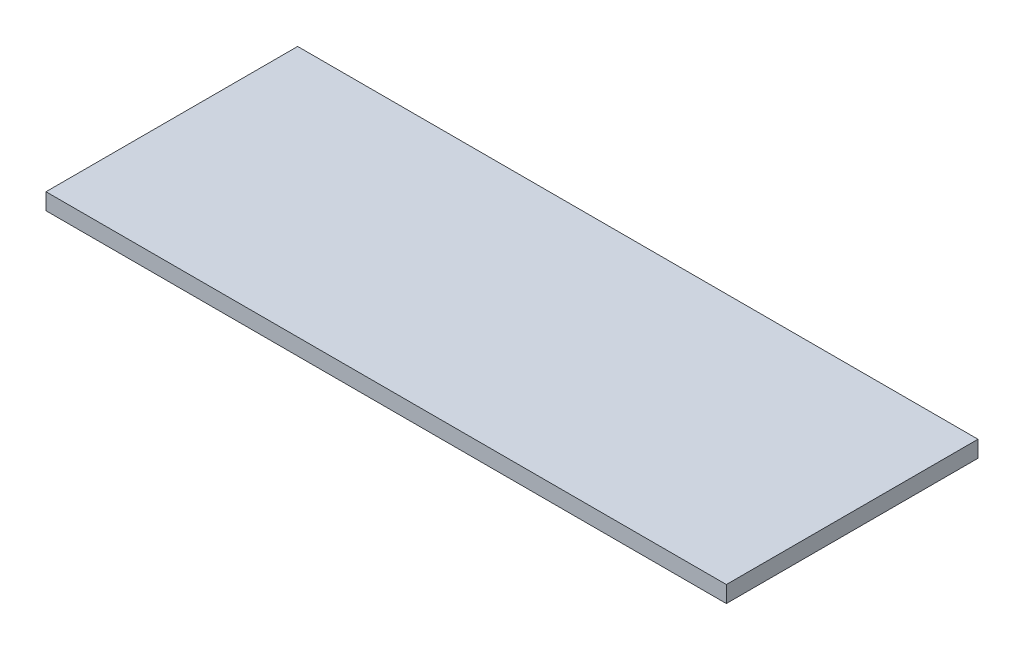
ISO-10303-21;
HEADER;
FILE_DESCRIPTION(('STEP AP214'),'2;1');
FILE_NAME('part.step','',(''),(''),'','','');
FILE_SCHEMA(('AUTOMOTIVE_DESIGN { 1 0 10303 214 1 1 1 1 }'));
ENDSEC;
DATA;
#1=APPLICATION_CONTEXT('core data for automotive mechanical design processes');
#2=APPLICATION_PROTOCOL_DEFINITION('international standard','automotive_design',2000,#1);
#3=PRODUCT_CONTEXT('',#1,'mechanical');
#4=PRODUCT('Part','Part','',(#3));
#5=PRODUCT_RELATED_PRODUCT_CATEGORY('part','',(#4));
#6=PRODUCT_DEFINITION_FORMATION('','',#4);
#7=PRODUCT_DEFINITION_CONTEXT('part definition',#1,'design');
#8=PRODUCT_DEFINITION('design','',#6,#7);
#9=PRODUCT_DEFINITION_SHAPE('','',#8);
#10=(LENGTH_UNIT() NAMED_UNIT(*) SI_UNIT(.MILLI.,.METRE.));
#11=(NAMED_UNIT(*) PLANE_ANGLE_UNIT() SI_UNIT($,.RADIAN.));
#12=(NAMED_UNIT(*) SI_UNIT($,.STERADIAN.) SOLID_ANGLE_UNIT());
#13=UNCERTAINTY_MEASURE_WITH_UNIT(LENGTH_MEASURE(1.E-05),#10,'distance_accuracy_value','');
#14=(GEOMETRIC_REPRESENTATION_CONTEXT(3) GLOBAL_UNCERTAINTY_ASSIGNED_CONTEXT((#13)) GLOBAL_UNIT_ASSIGNED_CONTEXT((#10,
#11,#12)) REPRESENTATION_CONTEXT('',''));
#15=CARTESIAN_POINT('',(0.,0.,0.));
#16=DIRECTION('',(0.,0.,1.));
#17=DIRECTION('',(1.,0.,0.));
#18=AXIS2_PLACEMENT_3D('',#15,#16,#17);
#19=CARTESIAN_POINT('',(0.,1.6,0.));
#20=DIRECTION('',(1.,0.,0.));
#21=DIRECTION('',(0.,0.,-1.));
#22=AXIS2_PLACEMENT_3D('',#19,#20,#21);
#23=PLANE('',#22);
#24=DIRECTION('',(0.,0.,1.));
#25=VECTOR('',#24,1.);
#26=CARTESIAN_POINT('',(0.,0.,0.));
#27=LINE('',#26,#25);
#28=CARTESIAN_POINT('',(0.,0.,-24.412));
#29=VERTEX_POINT('',#28);
#30=CARTESIAN_POINT('',(0.,0.,0.));
#31=VERTEX_POINT('',#30);
#32=EDGE_CURVE('E94',#29,#31,#27,.T.);
#33=ORIENTED_EDGE('',*,*,#32,.T.);
#34=DIRECTION('',(0.,-1.,0.));
#35=VECTOR('',#34,1.);
#36=CARTESIAN_POINT('',(0.,1.6,0.));
#37=LINE('',#36,#35);
#38=CARTESIAN_POINT('',(0.,1.6,0.));
#39=VERTEX_POINT('',#38);
#40=EDGE_CURVE('E11',#39,#31,#37,.T.);
#41=ORIENTED_EDGE('',*,*,#40,.F.);
#42=DIRECTION('',(0.,0.,1.));
#43=VECTOR('',#42,1.);
#44=CARTESIAN_POINT('',(0.,1.6,0.));
#45=LINE('',#44,#43);
#46=CARTESIAN_POINT('',(0.,1.6,-24.412));
#47=VERTEX_POINT('',#46);
#48=EDGE_CURVE('E82',#47,#39,#45,.T.);
#49=ORIENTED_EDGE('',*,*,#48,.F.);
#50=DIRECTION('',(0.,-1.,0.));
#51=VECTOR('',#50,1.);
#52=CARTESIAN_POINT('',(0.,1.6,-24.412));
#53=LINE('',#52,#51);
#54=EDGE_CURVE('E90',#47,#29,#53,.T.);
#55=ORIENTED_EDGE('',*,*,#54,.T.);
#56=EDGE_LOOP('',(#33,#41,#49,#55));
#57=FACE_BOUND('',#56,.T.);
#58=ADVANCED_FACE('F31',(#57),#23,.F.);
#59=CARTESIAN_POINT('',(0.,1.6,0.));
#60=DIRECTION('',(0.,0.,-1.));
#61=DIRECTION('',(-1.,0.,0.));
#62=AXIS2_PLACEMENT_3D('',#59,#60,#61);
#63=PLANE('',#62);
#64=DIRECTION('',(1.,0.,0.));
#65=VECTOR('',#64,1.);
#66=CARTESIAN_POINT('',(0.,0.,0.));
#67=LINE('',#66,#65);
#68=CARTESIAN_POINT('',(66.,0.,0.));
#69=VERTEX_POINT('',#68);
#70=EDGE_CURVE('E86',#31,#69,#67,.T.);
#71=ORIENTED_EDGE('',*,*,#70,.T.);
#72=DIRECTION('',(0.,-1.,0.));
#73=VECTOR('',#72,1.);
#74=CARTESIAN_POINT('',(66.,1.6,0.));
#75=LINE('',#74,#73);
#76=CARTESIAN_POINT('',(66.,1.6,0.));
#77=VERTEX_POINT('',#76);
#78=EDGE_CURVE('E39',#77,#69,#75,.T.);
#79=ORIENTED_EDGE('',*,*,#78,.F.);
#80=DIRECTION('',(1.,0.,0.));
#81=VECTOR('',#80,1.);
#82=CARTESIAN_POINT('',(0.,1.6,0.));
#83=LINE('',#82,#81);
#84=EDGE_CURVE('E77',#39,#77,#83,.T.);
#85=ORIENTED_EDGE('',*,*,#84,.F.);
#86=ORIENTED_EDGE('',*,*,#40,.T.);
#87=EDGE_LOOP('',(#71,#79,#85,#86));
#88=FACE_BOUND('',#87,.T.);
#89=ADVANCED_FACE('F85',(#88),#63,.F.);
#90=CARTESIAN_POINT('',(66.,1.6,0.));
#91=DIRECTION('',(-1.,0.,0.));
#92=DIRECTION('',(0.,0.,1.));
#93=AXIS2_PLACEMENT_3D('',#90,#91,#92);
#94=PLANE('',#93);
#95=DIRECTION('',(0.,0.,-1.));
#96=VECTOR('',#95,1.);
#97=CARTESIAN_POINT('',(66.,0.,0.));
#98=LINE('',#97,#96);
#99=CARTESIAN_POINT('',(66.,0.,-24.412));
#100=VERTEX_POINT('',#99);
#101=EDGE_CURVE('E64',#69,#100,#98,.T.);
#102=ORIENTED_EDGE('',*,*,#101,.T.);
#103=DIRECTION('',(0.,-1.,0.));
#104=VECTOR('',#103,1.);
#105=CARTESIAN_POINT('',(66.,1.6,-24.412));
#106=LINE('',#105,#104);
#107=CARTESIAN_POINT('',(66.,1.6,-24.412));
#108=VERTEX_POINT('',#107);
#109=EDGE_CURVE('E87',#108,#100,#106,.T.);
#110=ORIENTED_EDGE('',*,*,#109,.F.);
#111=DIRECTION('',(0.,0.,-1.));
#112=VECTOR('',#111,1.);
#113=CARTESIAN_POINT('',(66.,1.6,0.));
#114=LINE('',#113,#112);
#115=EDGE_CURVE('E80',#77,#108,#114,.T.);
#116=ORIENTED_EDGE('',*,*,#115,.F.);
#117=ORIENTED_EDGE('',*,*,#78,.T.);
#118=EDGE_LOOP('',(#102,#110,#116,#117));
#119=FACE_BOUND('',#118,.T.);
#120=ADVANCED_FACE('F88',(#119),#94,.F.);
#121=CARTESIAN_POINT('',(0.,1.6,-24.412));
#122=DIRECTION('',(0.,0.,1.));
#123=DIRECTION('',(1.,0.,0.));
#124=AXIS2_PLACEMENT_3D('',#121,#122,#123);
#125=PLANE('',#124);
#126=DIRECTION('',(-1.,0.,0.));
#127=VECTOR('',#126,1.);
#128=CARTESIAN_POINT('',(0.,0.,-24.412));
#129=LINE('',#128,#127);
#130=EDGE_CURVE('E70',#100,#29,#129,.T.);
#131=ORIENTED_EDGE('',*,*,#130,.T.);
#132=ORIENTED_EDGE('',*,*,#54,.F.);
#133=DIRECTION('',(-1.,0.,0.));
#134=VECTOR('',#133,1.);
#135=CARTESIAN_POINT('',(0.,1.6,-24.412));
#136=LINE('',#135,#134);
#137=EDGE_CURVE('E47',#108,#47,#136,.T.);
#138=ORIENTED_EDGE('',*,*,#137,.F.);
#139=ORIENTED_EDGE('',*,*,#109,.T.);
#140=EDGE_LOOP('',(#131,#132,#138,#139));
#141=FACE_BOUND('',#140,.T.);
#142=ADVANCED_FACE('F101',(#141),#125,.F.);
#143=CARTESIAN_POINT('',(0.,1.6,-24.412));
#144=DIRECTION('',(0.,-1.,0.));
#145=DIRECTION('',(0.,0.,-1.));
#146=AXIS2_PLACEMENT_3D('',#143,#144,#145);
#147=PLANE('',#146);
#148=ORIENTED_EDGE('',*,*,#48,.T.);
#149=ORIENTED_EDGE('',*,*,#84,.T.);
#150=ORIENTED_EDGE('',*,*,#115,.T.);
#151=ORIENTED_EDGE('',*,*,#137,.T.);
#152=EDGE_LOOP('',(#148,#149,#150,#151));
#153=FACE_BOUND('',#152,.T.);
#154=ADVANCED_FACE('F78',(#153),#147,.F.);
#155=CARTESIAN_POINT('',(0.,0.,-24.412));
#156=DIRECTION('',(0.,-1.,0.));
#157=DIRECTION('',(0.,0.,-1.));
#158=AXIS2_PLACEMENT_3D('',#155,#156,#157);
#159=PLANE('',#158);
#160=ORIENTED_EDGE('',*,*,#32,.F.);
#161=ORIENTED_EDGE('',*,*,#130,.F.);
#162=ORIENTED_EDGE('',*,*,#101,.F.);
#163=ORIENTED_EDGE('',*,*,#70,.F.);
#164=EDGE_LOOP('',(#160,#161,#162,#163));
#165=FACE_BOUND('',#164,.T.);
#166=ADVANCED_FACE('F104',(#165),#159,.T.);
#167=CLOSED_SHELL('',(#58,#89,#120,#142,#154,#166));
#168=MANIFOLD_SOLID_BREP('B2',#167);
#169=ADVANCED_BREP_SHAPE_REPRESENTATION('',(#18,#168),#14);
#170=SHAPE_DEFINITION_REPRESENTATION(#9,#169);
ENDSEC;
END-ISO-10303-21;
